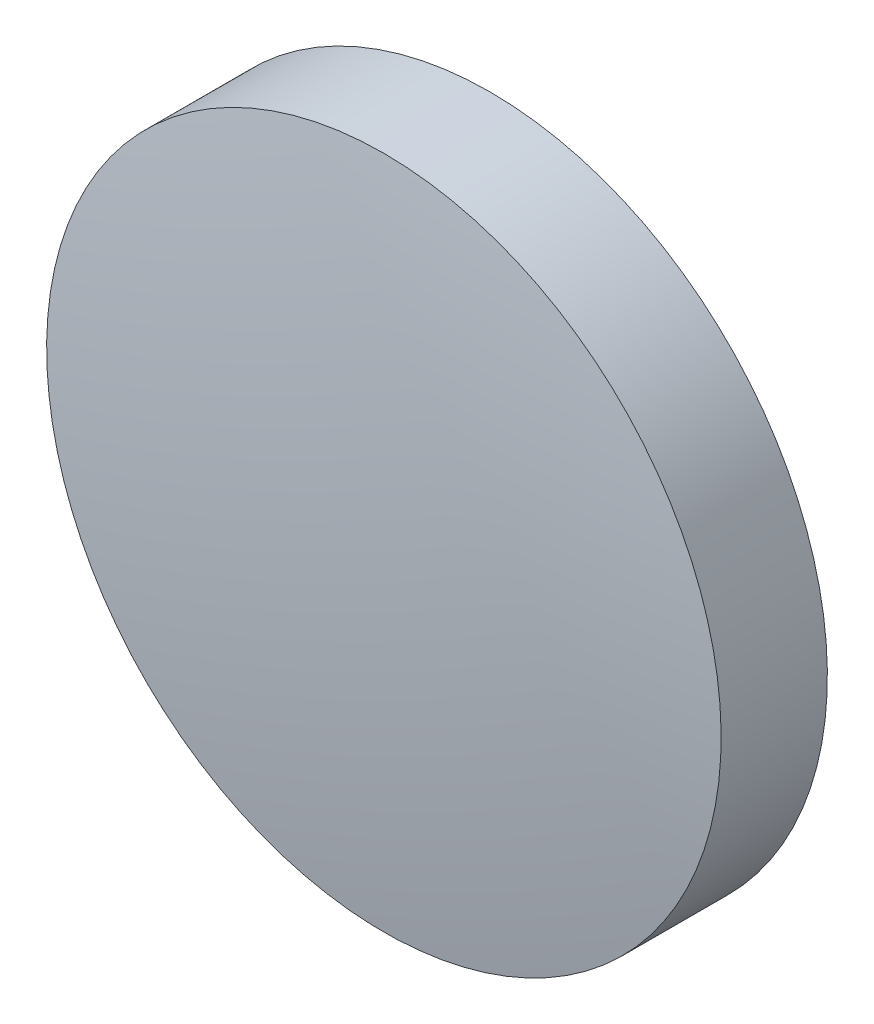
ISO-10303-21;
HEADER;
FILE_DESCRIPTION(('STEP AP214'),'2;1');
FILE_NAME('part.step','',(''),(''),'','','');
FILE_SCHEMA(('AUTOMOTIVE_DESIGN { 1 0 10303 214 1 1 1 1 }'));
ENDSEC;
DATA;
#1=APPLICATION_CONTEXT('core data for automotive mechanical design processes');
#2=APPLICATION_PROTOCOL_DEFINITION('international standard','automotive_design',2000,#1);
#3=PRODUCT_CONTEXT('',#1,'mechanical');
#4=PRODUCT('Part','Part','',(#3));
#5=PRODUCT_RELATED_PRODUCT_CATEGORY('part','',(#4));
#6=PRODUCT_DEFINITION_FORMATION('','',#4);
#7=PRODUCT_DEFINITION_CONTEXT('part definition',#1,'design');
#8=PRODUCT_DEFINITION('design','',#6,#7);
#9=PRODUCT_DEFINITION_SHAPE('','',#8);
#10=(LENGTH_UNIT() NAMED_UNIT(*) SI_UNIT(.MILLI.,.METRE.));
#11=(NAMED_UNIT(*) PLANE_ANGLE_UNIT() SI_UNIT($,.RADIAN.));
#12=(NAMED_UNIT(*) SI_UNIT($,.STERADIAN.) SOLID_ANGLE_UNIT());
#13=UNCERTAINTY_MEASURE_WITH_UNIT(LENGTH_MEASURE(1.E-05),#10,'distance_accuracy_value','');
#14=(GEOMETRIC_REPRESENTATION_CONTEXT(3) GLOBAL_UNCERTAINTY_ASSIGNED_CONTEXT((#13)) GLOBAL_UNIT_ASSIGNED_CONTEXT((#10,
#11,#12)) REPRESENTATION_CONTEXT('',''));
#15=CARTESIAN_POINT('',(0.,0.,0.));
#16=DIRECTION('',(0.,0.,1.));
#17=DIRECTION('',(1.,0.,0.));
#18=AXIS2_PLACEMENT_3D('',#15,#16,#17);
#19=CARTESIAN_POINT('',(0.,0.,-1.225));
#20=DIRECTION('',(0.,0.,-1.));
#21=DIRECTION('',(0.,1.,0.));
#22=AXIS2_PLACEMENT_3D('',#19,#20,#21);
#23=PLANE('',#22);
#24=CARTESIAN_POINT('',(0.,0.,-1.225));
#25=DIRECTION('',(0.,0.,-1.));
#26=DIRECTION('',(0.,1.,0.));
#27=AXIS2_PLACEMENT_3D('',#24,#25,#26);
#28=CIRCLE('',#27,6.35);
#29=CARTESIAN_POINT('',(0.,6.35,-1.225));
#30=VERTEX_POINT('',#29);
#31=EDGE_CURVE('E36',#30,#30,#28,.T.);
#32=ORIENTED_EDGE('',*,*,#31,.T.);
#33=EDGE_LOOP('',(#32));
#34=FACE_BOUND('',#33,.T.);
#35=ADVANCED_FACE('F30',(#34),#23,.T.);
#36=CARTESIAN_POINT('',(0.,0.,-43.8330000000002));
#37=DIRECTION('',(0.,0.,-1.));
#38=DIRECTION('',(0.,1.,0.));
#39=AXIS2_PLACEMENT_3D('',#36,#37,#38);
#40=SPHERICAL_SURFACE('',#39,45.0580000000002);
#41=CARTESIAN_POINT('',(0.,0.,0.775304877006845));
#42=DIRECTION('',(0.,0.,-1.));
#43=DIRECTION('',(0.,1.,0.));
#44=AXIS2_PLACEMENT_3D('',#41,#42,#43);
#45=CIRCLE('',#44,6.35000000000001);
#46=CARTESIAN_POINT('',(0.,6.35000000000001,0.775304877006847));
#47=VERTEX_POINT('',#46);
#48=EDGE_CURVE('E10',#47,#47,#45,.T.);
#49=ORIENTED_EDGE('',*,*,#48,.F.);
#50=EDGE_LOOP('',(#49));
#51=FACE_BOUND('',#50,.T.);
#52=ADVANCED_FACE('F45',(#51),#40,.T.);
#53=CARTESIAN_POINT('',(0.,0.,-1.225));
#54=DIRECTION('',(0.,0.,-1.));
#55=DIRECTION('',(0.,1.,0.));
#56=AXIS2_PLACEMENT_3D('',#53,#54,#55);
#57=CYLINDRICAL_SURFACE('',#56,6.35);
#58=ORIENTED_EDGE('',*,*,#48,.T.);
#59=EDGE_LOOP('',(#58));
#60=FACE_BOUND('',#59,.T.);
#61=ORIENTED_EDGE('',*,*,#31,.F.);
#62=EDGE_LOOP('',(#61));
#63=FACE_BOUND('',#62,.T.);
#64=ADVANCED_FACE('F43',(#60,#63),#57,.T.);
#65=CLOSED_SHELL('',(#35,#52,#64));
#66=MANIFOLD_SOLID_BREP('B2',#65);
#67=ADVANCED_BREP_SHAPE_REPRESENTATION('',(#18,#66),#14);
#68=SHAPE_DEFINITION_REPRESENTATION(#9,#67);
ENDSEC;
END-ISO-10303-21;
